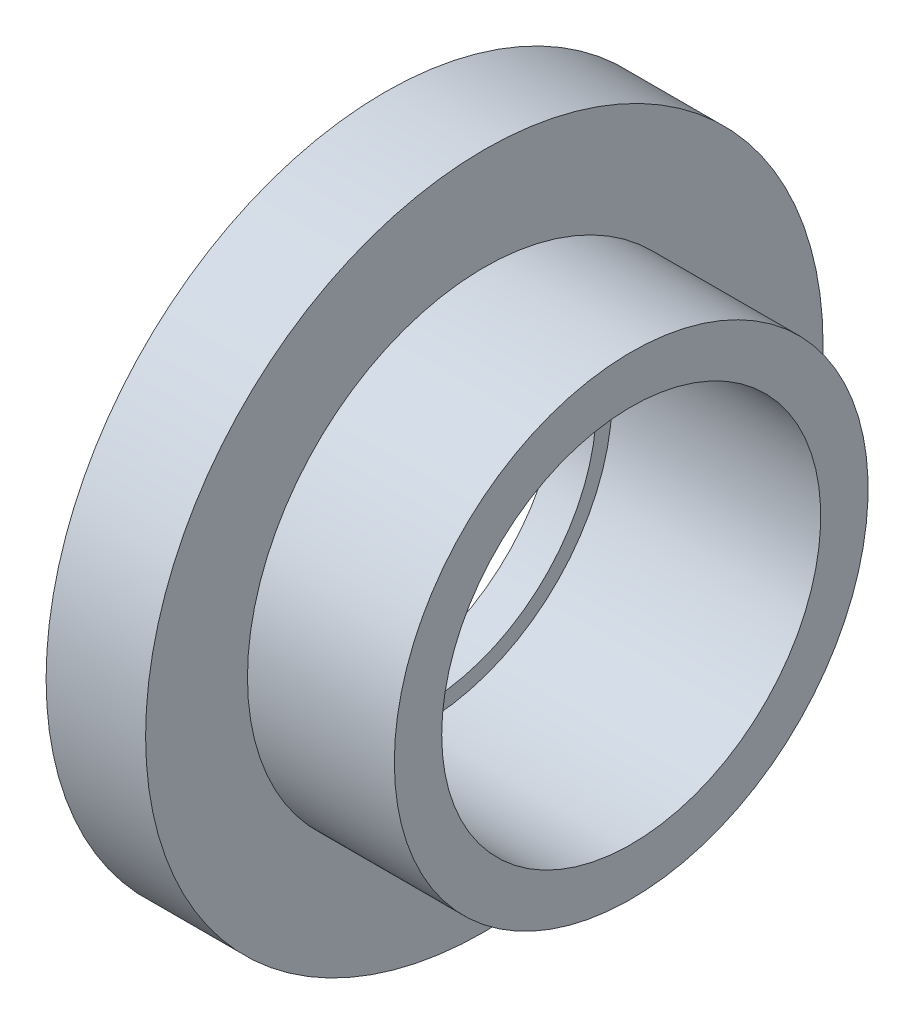
ISO-10303-21;
HEADER;
FILE_DESCRIPTION(('STEP AP214'),'2;1');
FILE_NAME('part.step','',(''),(''),'','','');
FILE_SCHEMA(('AUTOMOTIVE_DESIGN { 1 0 10303 214 1 1 1 1 }'));
ENDSEC;
DATA;
#1=APPLICATION_CONTEXT('core data for automotive mechanical design processes');
#2=APPLICATION_PROTOCOL_DEFINITION('international standard','automotive_design',2000,#1);
#3=PRODUCT_CONTEXT('',#1,'mechanical');
#4=PRODUCT('Part','Part','',(#3));
#5=PRODUCT_RELATED_PRODUCT_CATEGORY('part','',(#4));
#6=PRODUCT_DEFINITION_FORMATION('','',#4);
#7=PRODUCT_DEFINITION_CONTEXT('part definition',#1,'design');
#8=PRODUCT_DEFINITION('design','',#6,#7);
#9=PRODUCT_DEFINITION_SHAPE('','',#8);
#10=(LENGTH_UNIT() NAMED_UNIT(*) SI_UNIT(.MILLI.,.METRE.));
#11=(NAMED_UNIT(*) PLANE_ANGLE_UNIT() SI_UNIT($,.RADIAN.));
#12=(NAMED_UNIT(*) SI_UNIT($,.STERADIAN.) SOLID_ANGLE_UNIT());
#13=UNCERTAINTY_MEASURE_WITH_UNIT(LENGTH_MEASURE(1.E-05),#10,'distance_accuracy_value','');
#14=(GEOMETRIC_REPRESENTATION_CONTEXT(3) GLOBAL_UNCERTAINTY_ASSIGNED_CONTEXT((#13)) GLOBAL_UNIT_ASSIGNED_CONTEXT((#10,
#11,#12)) REPRESENTATION_CONTEXT('',''));
#15=CARTESIAN_POINT('',(0.,0.,0.));
#16=DIRECTION('',(0.,0.,1.));
#17=DIRECTION('',(1.,0.,0.));
#18=AXIS2_PLACEMENT_3D('',#15,#16,#17);
#19=CARTESIAN_POINT('',(6.5,0.,0.));
#20=DIRECTION('',(-1.,0.,0.));
#21=DIRECTION('',(0.,0.,1.));
#22=AXIS2_PLACEMENT_3D('',#19,#20,#21);
#23=CYLINDRICAL_SURFACE('',#22,25.);
#24=CARTESIAN_POINT('',(6.5,0.,0.));
#25=DIRECTION('',(-1.,0.,0.));
#26=DIRECTION('',(0.,0.,1.));
#27=AXIS2_PLACEMENT_3D('',#24,#25,#26);
#28=CIRCLE('',#27,25.);
#29=CARTESIAN_POINT('',(6.5,0.,25.));
#30=VERTEX_POINT('',#29);
#31=EDGE_CURVE('E38',#30,#30,#28,.T.);
#32=ORIENTED_EDGE('',*,*,#31,.F.);
#33=EDGE_LOOP('',(#32));
#34=FACE_BOUND('',#33,.T.);
#35=CARTESIAN_POINT('',(22.,0.,0.));
#36=DIRECTION('',(-1.,0.,0.));
#37=DIRECTION('',(0.,0.,1.));
#38=AXIS2_PLACEMENT_3D('',#35,#36,#37);
#39=CIRCLE('',#38,25.);
#40=CARTESIAN_POINT('',(22.,0.,25.));
#41=VERTEX_POINT('',#40);
#42=EDGE_CURVE('E16',#41,#41,#39,.F.);
#43=ORIENTED_EDGE('',*,*,#42,.F.);
#44=EDGE_LOOP('',(#43));
#45=FACE_BOUND('',#44,.T.);
#46=ADVANCED_FACE('F13',(#34,#45),#23,.T.);
#47=CARTESIAN_POINT('',(22.,25.,25.3000021083545));
#48=DIRECTION('',(1.,0.,0.));
#49=DIRECTION('',(0.,-1.,0.));
#50=AXIS2_PLACEMENT_3D('',#47,#48,#49);
#51=PLANE('',#50);
#52=CARTESIAN_POINT('',(22.,0.,0.));
#53=DIRECTION('',(-1.,0.,0.));
#54=DIRECTION('',(0.,0.,1.));
#55=AXIS2_PLACEMENT_3D('',#52,#53,#54);
#56=CIRCLE('',#55,20.);
#57=CARTESIAN_POINT('',(22.,0.,20.));
#58=VERTEX_POINT('',#57);
#59=EDGE_CURVE('E36',#58,#58,#56,.F.);
#60=ORIENTED_EDGE('',*,*,#59,.F.);
#61=EDGE_LOOP('',(#60));
#62=FACE_BOUND('',#61,.T.);
#63=ORIENTED_EDGE('',*,*,#42,.T.);
#64=EDGE_LOOP('',(#63));
#65=FACE_BOUND('',#64,.T.);
#66=ADVANCED_FACE('F45',(#62,#65),#51,.T.);
#67=CARTESIAN_POINT('',(6.5,35.75,36.1790021083975));
#68=DIRECTION('',(1.,0.,0.));
#69=DIRECTION('',(0.,-1.,0.));
#70=AXIS2_PLACEMENT_3D('',#67,#68,#69);
#71=PLANE('',#70);
#72=ORIENTED_EDGE('',*,*,#31,.T.);
#73=EDGE_LOOP('',(#72));
#74=FACE_BOUND('',#73,.T.);
#75=CARTESIAN_POINT('',(6.5,0.,0.));
#76=DIRECTION('',(-1.,0.,0.));
#77=DIRECTION('',(0.,0.,1.));
#78=AXIS2_PLACEMENT_3D('',#75,#76,#77);
#79=CIRCLE('',#78,35.75);
#80=CARTESIAN_POINT('',(6.5,0.,35.75));
#81=VERTEX_POINT('',#80);
#82=EDGE_CURVE('E33',#81,#81,#79,.T.);
#83=ORIENTED_EDGE('',*,*,#82,.F.);
#84=EDGE_LOOP('',(#83));
#85=FACE_BOUND('',#84,.T.);
#86=ADVANCED_FACE('F53',(#74,#85),#71,.T.);
#87=CARTESIAN_POINT('',(22.,0.,0.));
#88=DIRECTION('',(-1.,0.,0.));
#89=DIRECTION('',(0.,0.,1.));
#90=AXIS2_PLACEMENT_3D('',#87,#88,#89);
#91=CYLINDRICAL_SURFACE('',#90,20.);
#92=ORIENTED_EDGE('',*,*,#59,.T.);
#93=EDGE_LOOP('',(#92));
#94=FACE_BOUND('',#93,.T.);
#95=CARTESIAN_POINT('',(0.,0.,0.));
#96=DIRECTION('',(-1.,0.,0.));
#97=DIRECTION('',(0.,0.,1.));
#98=AXIS2_PLACEMENT_3D('',#95,#96,#97);
#99=CIRCLE('',#98,20.);
#100=CARTESIAN_POINT('',(0.,0.,20.));
#101=VERTEX_POINT('',#100);
#102=EDGE_CURVE('E30',#101,#101,#99,.F.);
#103=ORIENTED_EDGE('',*,*,#102,.F.);
#104=EDGE_LOOP('',(#103));
#105=FACE_BOUND('',#104,.T.);
#106=ADVANCED_FACE('F73',(#94,#105),#91,.F.);
#107=CARTESIAN_POINT('',(-4.,0.,0.));
#108=DIRECTION('',(-1.,0.,0.));
#109=DIRECTION('',(0.,0.,1.));
#110=AXIS2_PLACEMENT_3D('',#107,#108,#109);
#111=CYLINDRICAL_SURFACE('',#110,35.75);
#112=CARTESIAN_POINT('',(-4.,0.,0.));
#113=DIRECTION('',(-1.,0.,0.));
#114=DIRECTION('',(0.,0.,1.));
#115=AXIS2_PLACEMENT_3D('',#112,#113,#114);
#116=CIRCLE('',#115,35.75);
#117=CARTESIAN_POINT('',(-4.,0.,35.75));
#118=VERTEX_POINT('',#117);
#119=EDGE_CURVE('E25',#118,#118,#116,.T.);
#120=ORIENTED_EDGE('',*,*,#119,.F.);
#121=EDGE_LOOP('',(#120));
#122=FACE_BOUND('',#121,.T.);
#123=ORIENTED_EDGE('',*,*,#82,.T.);
#124=EDGE_LOOP('',(#123));
#125=FACE_BOUND('',#124,.T.);
#126=ADVANCED_FACE('F69',(#122,#125),#111,.T.);
#127=CARTESIAN_POINT('',(0.,20.,20.2400021083974));
#128=DIRECTION('',(1.,0.,0.));
#129=DIRECTION('',(0.,-1.,0.));
#130=AXIS2_PLACEMENT_3D('',#127,#128,#129);
#131=PLANE('',#130);
#132=CARTESIAN_POINT('',(0.,0.,0.));
#133=DIRECTION('',(-1.,0.,0.));
#134=DIRECTION('',(0.,0.,1.));
#135=AXIS2_PLACEMENT_3D('',#132,#133,#134);
#136=CIRCLE('',#135,18.3333333333333);
#137=CARTESIAN_POINT('',(0.,0.,18.3333333333333));
#138=VERTEX_POINT('',#137);
#139=EDGE_CURVE('E20',#138,#138,#136,.F.);
#140=ORIENTED_EDGE('',*,*,#139,.F.);
#141=EDGE_LOOP('',(#140));
#142=FACE_BOUND('',#141,.T.);
#143=ORIENTED_EDGE('',*,*,#102,.T.);
#144=EDGE_LOOP('',(#143));
#145=FACE_BOUND('',#144,.T.);
#146=ADVANCED_FACE('F63',(#142,#145),#131,.T.);
#147=CARTESIAN_POINT('',(-4.,-35.75,36.1790021083383));
#148=DIRECTION('',(-1.,0.,0.));
#149=DIRECTION('',(0.,1.,0.));
#150=AXIS2_PLACEMENT_3D('',#147,#148,#149);
#151=PLANE('',#150);
#152=CARTESIAN_POINT('',(-4.,0.,0.));
#153=DIRECTION('',(-1.,0.,0.));
#154=DIRECTION('',(0.,0.,1.));
#155=AXIS2_PLACEMENT_3D('',#152,#153,#154);
#156=CIRCLE('',#155,18.3333333333333);
#157=CARTESIAN_POINT('',(-4.,0.,18.3333333333333));
#158=VERTEX_POINT('',#157);
#159=EDGE_CURVE('E8',#158,#158,#156,.T.);
#160=ORIENTED_EDGE('',*,*,#159,.F.);
#161=EDGE_LOOP('',(#160));
#162=FACE_BOUND('',#161,.T.);
#163=ORIENTED_EDGE('',*,*,#119,.T.);
#164=EDGE_LOOP('',(#163));
#165=FACE_BOUND('',#164,.T.);
#166=ADVANCED_FACE('F57',(#162,#165),#151,.T.);
#167=CARTESIAN_POINT('',(0.,0.,0.));
#168=DIRECTION('',(-1.,0.,0.));
#169=DIRECTION('',(0.,0.,1.));
#170=AXIS2_PLACEMENT_3D('',#167,#168,#169);
#171=CYLINDRICAL_SURFACE('',#170,18.3333333333333);
#172=ORIENTED_EDGE('',*,*,#139,.T.);
#173=EDGE_LOOP('',(#172));
#174=FACE_BOUND('',#173,.T.);
#175=ORIENTED_EDGE('',*,*,#159,.T.);
#176=EDGE_LOOP('',(#175));
#177=FACE_BOUND('',#176,.T.);
#178=ADVANCED_FACE('F55',(#174,#177),#171,.F.);
#179=CLOSED_SHELL('',(#46,#66,#86,#106,#126,#146,#166,#178));
#180=MANIFOLD_SOLID_BREP('B1',#179);
#181=ADVANCED_BREP_SHAPE_REPRESENTATION('',(#18,#180),#14);
#182=SHAPE_DEFINITION_REPRESENTATION(#9,#181);
ENDSEC;
END-ISO-10303-21;
